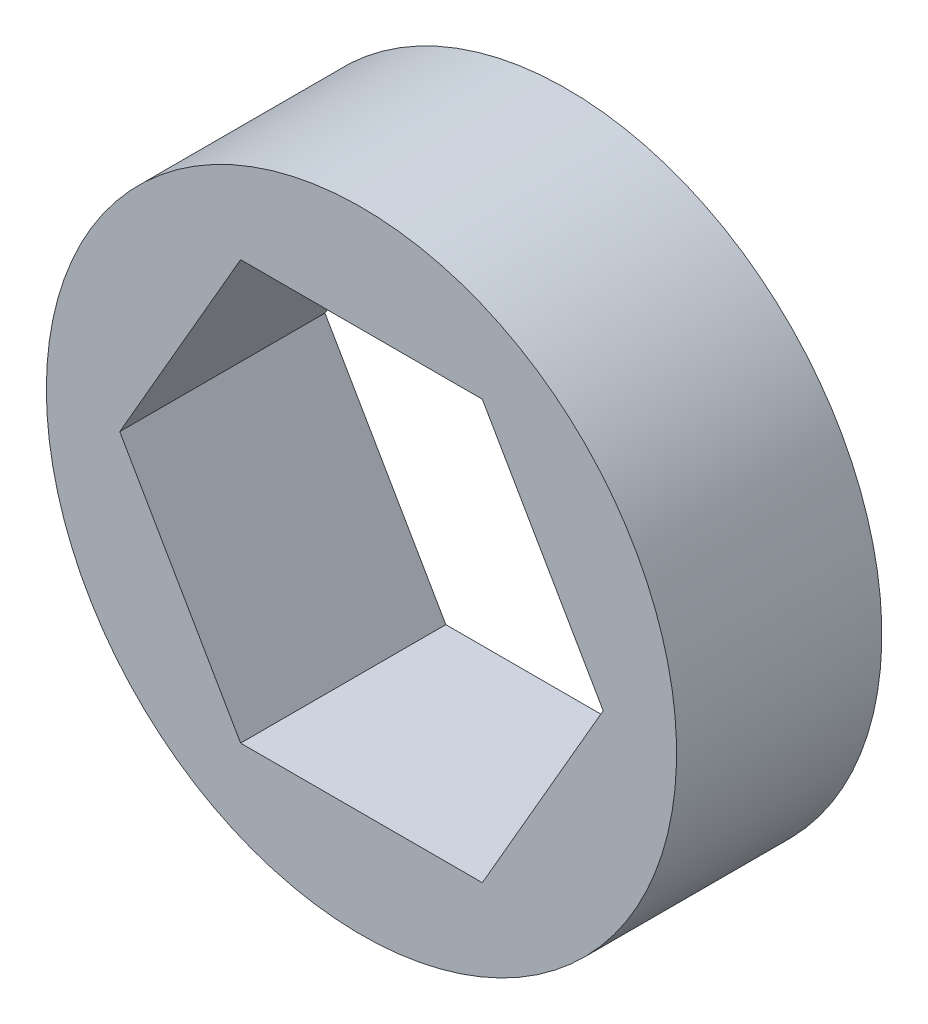
ISO-10303-21;
HEADER;
FILE_DESCRIPTION(('STEP AP214'),'2;1');
FILE_NAME('part.step','',(''),(''),'','','');
FILE_SCHEMA(('AUTOMOTIVE_DESIGN { 1 0 10303 214 1 1 1 1 }'));
ENDSEC;
DATA;
#1=APPLICATION_CONTEXT('core data for automotive mechanical design processes');
#2=APPLICATION_PROTOCOL_DEFINITION('international standard','automotive_design',2000,#1);
#3=PRODUCT_CONTEXT('',#1,'mechanical');
#4=PRODUCT('Part','Part','',(#3));
#5=PRODUCT_RELATED_PRODUCT_CATEGORY('part','',(#4));
#6=PRODUCT_DEFINITION_FORMATION('','',#4);
#7=PRODUCT_DEFINITION_CONTEXT('part definition',#1,'design');
#8=PRODUCT_DEFINITION('design','',#6,#7);
#9=PRODUCT_DEFINITION_SHAPE('','',#8);
#10=(LENGTH_UNIT() NAMED_UNIT(*) SI_UNIT(.MILLI.,.METRE.));
#11=(NAMED_UNIT(*) PLANE_ANGLE_UNIT() SI_UNIT($,.RADIAN.));
#12=(NAMED_UNIT(*) SI_UNIT($,.STERADIAN.) SOLID_ANGLE_UNIT());
#13=UNCERTAINTY_MEASURE_WITH_UNIT(LENGTH_MEASURE(1.E-05),#10,'distance_accuracy_value','');
#14=(GEOMETRIC_REPRESENTATION_CONTEXT(3) GLOBAL_UNCERTAINTY_ASSIGNED_CONTEXT((#13)) GLOBAL_UNIT_ASSIGNED_CONTEXT((#10,
#11,#12)) REPRESENTATION_CONTEXT('',''));
#15=CARTESIAN_POINT('',(0.,0.,0.));
#16=DIRECTION('',(0.,0.,1.));
#17=DIRECTION('',(1.,0.,0.));
#18=AXIS2_PLACEMENT_3D('',#15,#16,#17);
#19=CARTESIAN_POINT('',(-7.47899538708241,0.,3.175));
#20=DIRECTION('',(0.866025403784439,0.5,0.));
#21=DIRECTION('',(-0.5,0.866025403784439,0.));
#22=AXIS2_PLACEMENT_3D('',#19,#20,#21);
#23=PLANE('',#22);
#24=DIRECTION('',(-0.5,0.866025403784438,0.));
#25=VECTOR('',#24,1.);
#26=CARTESIAN_POINT('',(-3.73949769354121,-6.477,3.175));
#27=LINE('',#26,#25);
#28=CARTESIAN_POINT('',(-3.73949769354121,-6.477,3.175));
#29=VERTEX_POINT('',#28);
#30=CARTESIAN_POINT('',(-7.47899538708241,0.,3.175));
#31=VERTEX_POINT('',#30);
#32=EDGE_CURVE('E84',#29,#31,#27,.T.);
#33=ORIENTED_EDGE('',*,*,#32,.F.);
#34=DIRECTION('',(0.,0.,1.));
#35=VECTOR('',#34,1.);
#36=CARTESIAN_POINT('',(-3.73949769354121,-6.477,3.175));
#37=LINE('',#36,#35);
#38=CARTESIAN_POINT('',(-3.73949769354121,-6.477,-3.175));
#39=VERTEX_POINT('',#38);
#40=EDGE_CURVE('E76',#39,#29,#37,.T.);
#41=ORIENTED_EDGE('',*,*,#40,.F.);
#42=DIRECTION('',(-0.5,0.866025403784439,0.));
#43=VECTOR('',#42,1.);
#44=CARTESIAN_POINT('',(-3.73949769354121,-6.477,-3.175));
#45=LINE('',#44,#43);
#46=CARTESIAN_POINT('',(-7.47899538708241,0.,-3.175));
#47=VERTEX_POINT('',#46);
#48=EDGE_CURVE('E116',#39,#47,#45,.T.);
#49=ORIENTED_EDGE('',*,*,#48,.T.);
#50=DIRECTION('',(0.,0.,1.));
#51=VECTOR('',#50,1.);
#52=CARTESIAN_POINT('',(-7.47899538708241,0.,3.175));
#53=LINE('',#52,#51);
#54=EDGE_CURVE('E101',#31,#47,#53,.F.);
#55=ORIENTED_EDGE('',*,*,#54,.F.);
#56=EDGE_LOOP('',(#33,#41,#49,#55));
#57=FACE_BOUND('',#56,.T.);
#58=ADVANCED_FACE('F17',(#57),#23,.T.);
#59=CARTESIAN_POINT('',(-3.73949769354121,6.477,3.175));
#60=DIRECTION('',(0.866025403784439,-0.5,0.));
#61=DIRECTION('',(0.5,0.866025403784439,0.));
#62=AXIS2_PLACEMENT_3D('',#59,#60,#61);
#63=PLANE('',#62);
#64=DIRECTION('',(0.5,0.866025403784439,0.));
#65=VECTOR('',#64,1.);
#66=CARTESIAN_POINT('',(-7.47899538708242,0.,3.175));
#67=LINE('',#66,#65);
#68=CARTESIAN_POINT('',(-3.73949769354121,6.477,3.175));
#69=VERTEX_POINT('',#68);
#70=EDGE_CURVE('E109',#31,#69,#67,.T.);
#71=ORIENTED_EDGE('',*,*,#70,.F.);
#72=ORIENTED_EDGE('',*,*,#54,.T.);
#73=DIRECTION('',(0.5,0.866025403784439,0.));
#74=VECTOR('',#73,1.);
#75=CARTESIAN_POINT('',(-7.47899538708241,0.,-3.175));
#76=LINE('',#75,#74);
#77=CARTESIAN_POINT('',(-3.73949769354121,6.477,-3.175));
#78=VERTEX_POINT('',#77);
#79=EDGE_CURVE('E107',#47,#78,#76,.T.);
#80=ORIENTED_EDGE('',*,*,#79,.T.);
#81=DIRECTION('',(0.,0.,1.));
#82=VECTOR('',#81,1.);
#83=CARTESIAN_POINT('',(-3.73949769354121,6.477,3.175));
#84=LINE('',#83,#82);
#85=EDGE_CURVE('E98',#69,#78,#84,.F.);
#86=ORIENTED_EDGE('',*,*,#85,.F.);
#87=EDGE_LOOP('',(#71,#72,#80,#86));
#88=FACE_BOUND('',#87,.T.);
#89=ADVANCED_FACE('F106',(#88),#63,.T.);
#90=CARTESIAN_POINT('',(3.7394976935412,6.477,3.175));
#91=DIRECTION('',(0.,-1.,0.));
#92=DIRECTION('',(1.,0.,0.));
#93=AXIS2_PLACEMENT_3D('',#90,#91,#92);
#94=PLANE('',#93);
#95=DIRECTION('',(1.,0.,0.));
#96=VECTOR('',#95,1.);
#97=CARTESIAN_POINT('',(0.,6.477,3.175));
#98=LINE('',#97,#96);
#99=CARTESIAN_POINT('',(3.7394976935412,6.477,3.175));
#100=VERTEX_POINT('',#99);
#101=EDGE_CURVE('E126',#69,#100,#98,.T.);
#102=ORIENTED_EDGE('',*,*,#101,.F.);
#103=ORIENTED_EDGE('',*,*,#85,.T.);
#104=DIRECTION('',(1.,0.,0.));
#105=VECTOR('',#104,1.);
#106=CARTESIAN_POINT('',(0.,6.477,-3.175));
#107=LINE('',#106,#105);
#108=CARTESIAN_POINT('',(3.7394976935412,6.477,-3.175));
#109=VERTEX_POINT('',#108);
#110=EDGE_CURVE('E118',#78,#109,#107,.T.);
#111=ORIENTED_EDGE('',*,*,#110,.T.);
#112=DIRECTION('',(0.,0.,1.));
#113=VECTOR('',#112,1.);
#114=CARTESIAN_POINT('',(3.7394976935412,6.47700000000001,3.175));
#115=LINE('',#114,#113);
#116=EDGE_CURVE('E95',#100,#109,#115,.F.);
#117=ORIENTED_EDGE('',*,*,#116,.F.);
#118=EDGE_LOOP('',(#102,#103,#111,#117));
#119=FACE_BOUND('',#118,.T.);
#120=ADVANCED_FACE('F135',(#119),#94,.T.);
#121=CARTESIAN_POINT('',(7.47899538708241,0.,3.175));
#122=DIRECTION('',(-0.866025403784439,-0.5,0.));
#123=DIRECTION('',(0.5,-0.866025403784439,0.));
#124=AXIS2_PLACEMENT_3D('',#121,#122,#123);
#125=PLANE('',#124);
#126=DIRECTION('',(0.5,-0.866025403784438,0.));
#127=VECTOR('',#126,1.);
#128=CARTESIAN_POINT('',(3.7394976935412,6.477,3.175));
#129=LINE('',#128,#127);
#130=CARTESIAN_POINT('',(7.47899538708242,0.,3.175));
#131=VERTEX_POINT('',#130);
#132=EDGE_CURVE('E89',#100,#131,#129,.T.);
#133=ORIENTED_EDGE('',*,*,#132,.F.);
#134=ORIENTED_EDGE('',*,*,#116,.T.);
#135=DIRECTION('',(0.5,-0.866025403784438,0.));
#136=VECTOR('',#135,1.);
#137=CARTESIAN_POINT('',(3.7394976935412,6.477,-3.175));
#138=LINE('',#137,#136);
#139=CARTESIAN_POINT('',(7.47899538708241,0.,-3.175));
#140=VERTEX_POINT('',#139);
#141=EDGE_CURVE('E120',#109,#140,#138,.T.);
#142=ORIENTED_EDGE('',*,*,#141,.T.);
#143=DIRECTION('',(0.,0.,1.));
#144=VECTOR('',#143,1.);
#145=CARTESIAN_POINT('',(7.47899538708242,0.,3.175));
#146=LINE('',#145,#144);
#147=EDGE_CURVE('E65',#131,#140,#146,.F.);
#148=ORIENTED_EDGE('',*,*,#147,.F.);
#149=EDGE_LOOP('',(#133,#134,#142,#148));
#150=FACE_BOUND('',#149,.T.);
#151=ADVANCED_FACE('F132',(#150),#125,.T.);
#152=CARTESIAN_POINT('',(3.73949769354121,-6.477,3.175));
#153=DIRECTION('',(-0.866025403784439,0.5,0.));
#154=DIRECTION('',(-0.5,-0.866025403784439,0.));
#155=AXIS2_PLACEMENT_3D('',#152,#153,#154);
#156=PLANE('',#155);
#157=DIRECTION('',(-0.5,-0.866025403784439,0.));
#158=VECTOR('',#157,1.);
#159=CARTESIAN_POINT('',(7.47899538708241,0.,3.175));
#160=LINE('',#159,#158);
#161=CARTESIAN_POINT('',(3.73949769354121,-6.477,3.175));
#162=VERTEX_POINT('',#161);
#163=EDGE_CURVE('E71',#131,#162,#160,.T.);
#164=ORIENTED_EDGE('',*,*,#163,.F.);
#165=ORIENTED_EDGE('',*,*,#147,.T.);
#166=DIRECTION('',(-0.5,-0.866025403784439,0.));
#167=VECTOR('',#166,1.);
#168=CARTESIAN_POINT('',(7.47899538708241,0.,-3.175));
#169=LINE('',#168,#167);
#170=CARTESIAN_POINT('',(3.73949769354121,-6.477,-3.175));
#171=VERTEX_POINT('',#170);
#172=EDGE_CURVE('E33',#140,#171,#169,.T.);
#173=ORIENTED_EDGE('',*,*,#172,.T.);
#174=DIRECTION('',(0.,0.,1.));
#175=VECTOR('',#174,1.);
#176=CARTESIAN_POINT('',(3.73949769354121,-6.477,3.175));
#177=LINE('',#176,#175);
#178=EDGE_CURVE('E67',#162,#171,#177,.F.);
#179=ORIENTED_EDGE('',*,*,#178,.F.);
#180=EDGE_LOOP('',(#164,#165,#173,#179));
#181=FACE_BOUND('',#180,.T.);
#182=ADVANCED_FACE('F69',(#181),#156,.T.);
#183=CARTESIAN_POINT('',(-3.73949769354121,-6.477,3.175));
#184=DIRECTION('',(0.,1.,0.));
#185=DIRECTION('',(0.,0.,1.));
#186=AXIS2_PLACEMENT_3D('',#183,#184,#185);
#187=PLANE('',#186);
#188=DIRECTION('',(1.,0.,0.));
#189=VECTOR('',#188,1.);
#190=CARTESIAN_POINT('',(0.,-6.477,3.175));
#191=LINE('',#190,#189);
#192=EDGE_CURVE('E79',#162,#29,#191,.F.);
#193=ORIENTED_EDGE('',*,*,#192,.F.);
#194=ORIENTED_EDGE('',*,*,#178,.T.);
#195=DIRECTION('',(1.,0.,0.));
#196=VECTOR('',#195,1.);
#197=CARTESIAN_POINT('',(0.,-6.477,-3.175));
#198=LINE('',#197,#196);
#199=EDGE_CURVE('E128',#171,#39,#198,.F.);
#200=ORIENTED_EDGE('',*,*,#199,.T.);
#201=ORIENTED_EDGE('',*,*,#40,.T.);
#202=EDGE_LOOP('',(#193,#194,#200,#201));
#203=FACE_BOUND('',#202,.T.);
#204=ADVANCED_FACE('F80',(#203),#187,.T.);
#205=CARTESIAN_POINT('',(0.,0.,3.175));
#206=DIRECTION('',(0.,0.,1.));
#207=DIRECTION('',(1.,0.,0.));
#208=AXIS2_PLACEMENT_3D('',#205,#206,#207);
#209=PLANE('',#208);
#210=ORIENTED_EDGE('',*,*,#101,.T.);
#211=ORIENTED_EDGE('',*,*,#132,.T.);
#212=ORIENTED_EDGE('',*,*,#163,.T.);
#213=ORIENTED_EDGE('',*,*,#192,.T.);
#214=ORIENTED_EDGE('',*,*,#32,.T.);
#215=ORIENTED_EDGE('',*,*,#70,.T.);
#216=EDGE_LOOP('',(#210,#211,#212,#213,#214,#215));
#217=FACE_BOUND('',#216,.T.);
#218=CARTESIAN_POINT('',(0.,0.,3.175));
#219=DIRECTION('',(0.,0.,-1.));
#220=DIRECTION('',(-1.,0.,0.));
#221=AXIS2_PLACEMENT_3D('',#218,#219,#220);
#222=CIRCLE('',#221,9.75);
#223=CARTESIAN_POINT('',(-9.75,0.,3.175));
#224=VERTEX_POINT('',#223);
#225=EDGE_CURVE('E20',#224,#224,#222,.T.);
#226=ORIENTED_EDGE('',*,*,#225,.F.);
#227=EDGE_LOOP('',(#226));
#228=FACE_BOUND('',#227,.T.);
#229=ADVANCED_FACE('F87',(#217,#228),#209,.T.);
#230=CARTESIAN_POINT('',(0.,0.,-3.175));
#231=DIRECTION('',(0.,0.,1.));
#232=DIRECTION('',(1.,0.,0.));
#233=AXIS2_PLACEMENT_3D('',#230,#231,#232);
#234=PLANE('',#233);
#235=ORIENTED_EDGE('',*,*,#172,.F.);
#236=ORIENTED_EDGE('',*,*,#141,.F.);
#237=ORIENTED_EDGE('',*,*,#110,.F.);
#238=ORIENTED_EDGE('',*,*,#79,.F.);
#239=ORIENTED_EDGE('',*,*,#48,.F.);
#240=ORIENTED_EDGE('',*,*,#199,.F.);
#241=EDGE_LOOP('',(#235,#236,#237,#238,#239,#240));
#242=FACE_BOUND('',#241,.T.);
#243=CARTESIAN_POINT('',(0.,0.,-3.175));
#244=DIRECTION('',(0.,0.,-1.));
#245=DIRECTION('',(-1.,0.,0.));
#246=AXIS2_PLACEMENT_3D('',#243,#244,#245);
#247=CIRCLE('',#246,9.75);
#248=CARTESIAN_POINT('',(-9.75,0.,-3.175));
#249=VERTEX_POINT('',#248);
#250=EDGE_CURVE('E11',#249,#249,#247,.F.);
#251=ORIENTED_EDGE('',*,*,#250,.F.);
#252=EDGE_LOOP('',(#251));
#253=FACE_BOUND('',#252,.T.);
#254=ADVANCED_FACE('F114',(#242,#253),#234,.F.);
#255=CARTESIAN_POINT('',(0.,0.,3.175));
#256=DIRECTION('',(0.,0.,-1.));
#257=DIRECTION('',(-1.,0.,0.));
#258=AXIS2_PLACEMENT_3D('',#255,#256,#257);
#259=CYLINDRICAL_SURFACE('',#258,9.75);
#260=ORIENTED_EDGE('',*,*,#250,.T.);
#261=EDGE_LOOP('',(#260));
#262=FACE_BOUND('',#261,.T.);
#263=ORIENTED_EDGE('',*,*,#225,.T.);
#264=EDGE_LOOP('',(#263));
#265=FACE_BOUND('',#264,.T.);
#266=ADVANCED_FACE('F144',(#262,#265),#259,.T.);
#267=CLOSED_SHELL('',(#58,#89,#120,#151,#182,#204,#229,#254,#266));
#268=MANIFOLD_SOLID_BREP('B1',#267);
#269=ADVANCED_BREP_SHAPE_REPRESENTATION('',(#18,#268),#14);
#270=SHAPE_DEFINITION_REPRESENTATION(#9,#269);
ENDSEC;
END-ISO-10303-21;
